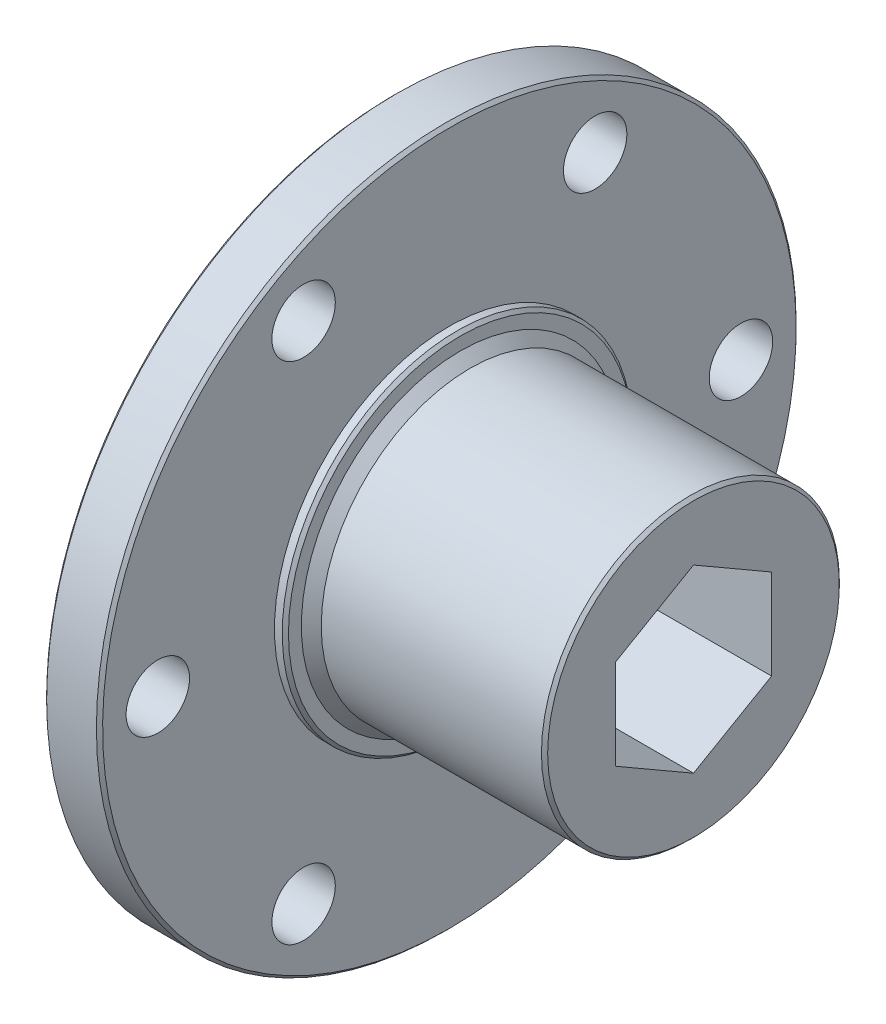
ISO-10303-21;
HEADER;
FILE_DESCRIPTION(('STEP AP214'),'2;1');
FILE_NAME('part.step','',(''),(''),'','','');
FILE_SCHEMA(('AUTOMOTIVE_DESIGN { 1 0 10303 214 1 1 1 1 }'));
ENDSEC;
DATA;
#1=APPLICATION_CONTEXT('core data for automotive mechanical design processes');
#2=APPLICATION_PROTOCOL_DEFINITION('international standard','automotive_design',2000,#1);
#3=PRODUCT_CONTEXT('',#1,'mechanical');
#4=PRODUCT('Part','Part','',(#3));
#5=PRODUCT_RELATED_PRODUCT_CATEGORY('part','',(#4));
#6=PRODUCT_DEFINITION_FORMATION('','',#4);
#7=PRODUCT_DEFINITION_CONTEXT('part definition',#1,'design');
#8=PRODUCT_DEFINITION('design','',#6,#7);
#9=PRODUCT_DEFINITION_SHAPE('','',#8);
#10=(LENGTH_UNIT() NAMED_UNIT(*) SI_UNIT(.MILLI.,.METRE.));
#11=(NAMED_UNIT(*) PLANE_ANGLE_UNIT() SI_UNIT($,.RADIAN.));
#12=(NAMED_UNIT(*) SI_UNIT($,.STERADIAN.) SOLID_ANGLE_UNIT());
#13=UNCERTAINTY_MEASURE_WITH_UNIT(LENGTH_MEASURE(1.E-05),#10,'distance_accuracy_value','');
#14=(GEOMETRIC_REPRESENTATION_CONTEXT(3) GLOBAL_UNCERTAINTY_ASSIGNED_CONTEXT((#13)) GLOBAL_UNIT_ASSIGNED_CONTEXT((#10,
#11,#12)) REPRESENTATION_CONTEXT('',''));
#15=CARTESIAN_POINT('',(0.,0.,0.));
#16=DIRECTION('',(0.,0.,1.));
#17=DIRECTION('',(1.,0.,0.));
#18=AXIS2_PLACEMENT_3D('',#15,#16,#17);
#19=CARTESIAN_POINT('',(6.01493375394323,0.,0.));
#20=DIRECTION('',(-1.,0.,0.));
#21=DIRECTION('',(0.,0.,1.));
#22=AXIS2_PLACEMENT_3D('',#19,#20,#21);
#23=CYLINDRICAL_SURFACE('',#22,12.1666);
#24=CARTESIAN_POINT('',(5.76093375394327,0.,0.));
#25=DIRECTION('',(-1.,0.,0.));
#26=DIRECTION('',(0.,0.,1.));
#27=AXIS2_PLACEMENT_3D('',#24,#25,#26);
#28=CIRCLE('',#27,12.1666);
#29=CARTESIAN_POINT('',(5.76093375394327,0.,12.1666));
#30=VERTEX_POINT('',#29);
#31=EDGE_CURVE('E117',#30,#30,#28,.F.);
#32=ORIENTED_EDGE('',*,*,#31,.F.);
#33=EDGE_LOOP('',(#32));
#34=FACE_BOUND('',#33,.T.);
#35=CARTESIAN_POINT('',(-12.2222662460567,0.,0.));
#36=DIRECTION('',(-1.,0.,0.));
#37=DIRECTION('',(0.,0.,1.));
#38=AXIS2_PLACEMENT_3D('',#35,#36,#37);
#39=CIRCLE('',#38,12.1666);
#40=CARTESIAN_POINT('',(-12.2222662460567,0.,12.1666));
#41=VERTEX_POINT('',#40);
#42=EDGE_CURVE('E113',#41,#41,#39,.T.);
#43=ORIENTED_EDGE('',*,*,#42,.F.);
#44=EDGE_LOOP('',(#43));
#45=FACE_BOUND('',#44,.T.);
#46=ADVANCED_FACE('F16',(#34,#45),#23,.T.);
#47=CARTESIAN_POINT('',(5.76093375394327,0.,0.));
#48=DIRECTION('',(-1.,0.,0.));
#49=DIRECTION('',(0.,0.,1.));
#50=AXIS2_PLACEMENT_3D('',#47,#48,#49);
#51=CONICAL_SURFACE('',#50,12.1666,0.785398163397465);
#52=ORIENTED_EDGE('',*,*,#31,.T.);
#53=EDGE_LOOP('',(#52));
#54=FACE_BOUND('',#53,.T.);
#55=CARTESIAN_POINT('',(6.01493375394323,0.,0.));
#56=DIRECTION('',(-1.,0.,0.));
#57=DIRECTION('',(0.,0.,1.));
#58=AXIS2_PLACEMENT_3D('',#55,#56,#57);
#59=CIRCLE('',#58,11.9126);
#60=CARTESIAN_POINT('',(6.01493375394323,0.,11.9126));
#61=VERTEX_POINT('',#60);
#62=EDGE_CURVE('E19',#61,#61,#59,.F.);
#63=ORIENTED_EDGE('',*,*,#62,.F.);
#64=EDGE_LOOP('',(#63));
#65=FACE_BOUND('',#64,.T.);
#66=ADVANCED_FACE('F194',(#54,#65),#51,.T.);
#67=CARTESIAN_POINT('',(-13.0350662460568,0.,0.));
#68=DIRECTION('',(-1.,0.,0.));
#69=DIRECTION('',(0.,-1.,0.));
#70=AXIS2_PLACEMENT_3D('',#67,#68,#69);
#71=CONICAL_SURFACE('',#70,12.9794,0.785398163397438);
#72=ORIENTED_EDGE('',*,*,#42,.T.);
#73=EDGE_LOOP('',(#72));
#74=FACE_BOUND('',#73,.T.);
#75=CARTESIAN_POINT('',(-13.0350662460568,0.,0.));
#76=DIRECTION('',(-1.,0.,0.));
#77=DIRECTION('',(0.,-1.,0.));
#78=AXIS2_PLACEMENT_3D('',#75,#76,#77);
#79=CIRCLE('',#78,12.9794);
#80=CARTESIAN_POINT('',(-13.0350662460568,-12.9794,0.));
#81=VERTEX_POINT('',#80);
#82=EDGE_CURVE('E92',#81,#81,#79,.T.);
#83=ORIENTED_EDGE('',*,*,#82,.F.);
#84=EDGE_LOOP('',(#83));
#85=FACE_BOUND('',#84,.T.);
#86=ADVANCED_FACE('F196',(#74,#85),#71,.T.);
#87=CARTESIAN_POINT('',(6.01493375394323,0.,0.));
#88=DIRECTION('',(1.,0.,0.));
#89=DIRECTION('',(0.,0.,-1.));
#90=AXIS2_PLACEMENT_3D('',#87,#88,#89);
#91=PLANE('',#90);
#92=DIRECTION('',(0.,1.,0.));
#93=VECTOR('',#92,1.);
#94=CARTESIAN_POINT('',(6.01493375394323,-3.68085890619153,-6.37539999999999));
#95=LINE('',#94,#93);
#96=CARTESIAN_POINT('',(6.01493375394323,3.68081890619155,-6.37539999999999));
#97=VERTEX_POINT('',#96);
#98=CARTESIAN_POINT('',(6.01493375394323,-3.68085890619153,-6.37539999999999));
#99=VERTEX_POINT('',#98);
#100=EDGE_CURVE('E102',#97,#99,#95,.F.);
#101=ORIENTED_EDGE('',*,*,#100,.T.);
#102=DIRECTION('',(0.,0.500000000000001,-0.866025403784438));
#103=VECTOR('',#102,1.);
#104=CARTESIAN_POINT('',(6.01493375394323,-7.36169781238308,0.));
#105=LINE('',#104,#103);
#106=CARTESIAN_POINT('',(6.01493375394323,-7.36169781238308,0.));
#107=VERTEX_POINT('',#106);
#108=EDGE_CURVE('E75',#99,#107,#105,.F.);
#109=ORIENTED_EDGE('',*,*,#108,.T.);
#110=DIRECTION('',(0.,-0.500000000000001,-0.866025403784438));
#111=VECTOR('',#110,1.);
#112=CARTESIAN_POINT('',(6.01493375394323,-3.68085890619153,6.3754));
#113=LINE('',#112,#111);
#114=CARTESIAN_POINT('',(6.01493375394323,-3.68085890619153,6.3754));
#115=VERTEX_POINT('',#114);
#116=EDGE_CURVE('E82',#107,#115,#113,.F.);
#117=ORIENTED_EDGE('',*,*,#116,.T.);
#118=DIRECTION('',(0.,-1.,0.));
#119=VECTOR('',#118,1.);
#120=CARTESIAN_POINT('',(6.01493375394323,3.68081890619155,6.3754));
#121=LINE('',#120,#119);
#122=CARTESIAN_POINT('',(6.01493375394323,3.68081890619155,6.3754));
#123=VERTEX_POINT('',#122);
#124=EDGE_CURVE('E185',#115,#123,#121,.F.);
#125=ORIENTED_EDGE('',*,*,#124,.T.);
#126=DIRECTION('',(0.,-0.500000000000001,0.866025403784438));
#127=VECTOR('',#126,1.);
#128=CARTESIAN_POINT('',(6.01493375394323,7.3616578123831,0.));
#129=LINE('',#128,#127);
#130=CARTESIAN_POINT('',(6.01493375394323,7.3616578123831,0.));
#131=VERTEX_POINT('',#130);
#132=EDGE_CURVE('E517',#123,#131,#129,.F.);
#133=ORIENTED_EDGE('',*,*,#132,.T.);
#134=DIRECTION('',(0.,0.500000000000001,0.866025403784438));
#135=VECTOR('',#134,1.);
#136=CARTESIAN_POINT('',(6.01493375394323,3.68081890619155,-6.37539999999999));
#137=LINE('',#136,#135);
#138=EDGE_CURVE('E525',#131,#97,#137,.F.);
#139=ORIENTED_EDGE('',*,*,#138,.T.);
#140=EDGE_LOOP('',(#101,#109,#117,#125,#133,#139));
#141=FACE_BOUND('',#140,.T.);
#142=ORIENTED_EDGE('',*,*,#62,.T.);
#143=EDGE_LOOP('',(#142));
#144=FACE_BOUND('',#143,.T.);
#145=ADVANCED_FACE('F99',(#141,#144),#91,.T.);
#146=CARTESIAN_POINT('',(-13.0350662460568,28.575,0.));
#147=DIRECTION('',(1.,0.,0.));
#148=DIRECTION('',(0.,0.,-1.));
#149=AXIS2_PLACEMENT_3D('',#146,#147,#148);
#150=PLANE('',#149);
#151=ORIENTED_EDGE('',*,*,#82,.T.);
#152=EDGE_LOOP('',(#151));
#153=FACE_BOUND('',#152,.T.);
#154=CARTESIAN_POINT('',(-13.0350662460568,0.,0.));
#155=DIRECTION('',(-1.,0.,0.));
#156=DIRECTION('',(0.,-1.,0.));
#157=AXIS2_PLACEMENT_3D('',#154,#155,#156);
#158=CIRCLE('',#157,14.0335);
#159=CARTESIAN_POINT('',(-13.0350662460568,-14.0335,0.));
#160=VERTEX_POINT('',#159);
#161=EDGE_CURVE('E181',#160,#160,#158,.T.);
#162=ORIENTED_EDGE('',*,*,#161,.F.);
#163=EDGE_LOOP('',(#162));
#164=FACE_BOUND('',#163,.T.);
#165=ADVANCED_FACE('F294',(#153,#164),#150,.T.);
#166=CARTESIAN_POINT('',(-19.3850662460568,-3.68085890619153,6.3754));
#167=DIRECTION('',(0.,-0.866025403784438,0.500000000000001));
#168=DIRECTION('',(0.,-0.500000000000001,-0.866025403784438));
#169=AXIS2_PLACEMENT_3D('',#166,#167,#168);
#170=PLANE('',#169);
#171=DIRECTION('',(1.,0.,0.));
#172=VECTOR('',#171,1.);
#173=CARTESIAN_POINT('',(-19.3850662460568,-7.36169781238308,0.));
#174=LINE('',#173,#172);
#175=CARTESIAN_POINT('',(-19.3850662460568,-7.36169781238308,0.));
#176=VERTEX_POINT('',#175);
#177=EDGE_CURVE('E85',#107,#176,#174,.F.);
#178=ORIENTED_EDGE('',*,*,#177,.T.);
#179=DIRECTION('',(0.,-0.500000000000001,-0.866025403784438));
#180=VECTOR('',#179,1.);
#181=CARTESIAN_POINT('',(-19.3850662460568,-3.68085890619153,6.3754));
#182=LINE('',#181,#180);
#183=CARTESIAN_POINT('',(-19.3850662460568,-3.68085890619153,6.3754));
#184=VERTEX_POINT('',#183);
#185=EDGE_CURVE('E184',#184,#176,#182,.T.);
#186=ORIENTED_EDGE('',*,*,#185,.F.);
#187=DIRECTION('',(1.,0.,0.));
#188=VECTOR('',#187,1.);
#189=CARTESIAN_POINT('',(-19.3850662460568,-3.68085890619153,6.3754));
#190=LINE('',#189,#188);
#191=EDGE_CURVE('E87',#184,#115,#190,.T.);
#192=ORIENTED_EDGE('',*,*,#191,.T.);
#193=ORIENTED_EDGE('',*,*,#116,.F.);
#194=EDGE_LOOP('',(#178,#186,#192,#193));
#195=FACE_BOUND('',#194,.T.);
#196=ADVANCED_FACE('F83',(#195),#170,.F.);
#197=CARTESIAN_POINT('',(-19.3850662460568,-7.36169781238308,0.));
#198=DIRECTION('',(0.,-0.866025403784438,-0.500000000000001));
#199=DIRECTION('',(0.,0.500000000000001,-0.866025403784438));
#200=AXIS2_PLACEMENT_3D('',#197,#198,#199);
#201=PLANE('',#200);
#202=DIRECTION('',(1.,0.,0.));
#203=VECTOR('',#202,1.);
#204=CARTESIAN_POINT('',(-19.3850662460568,-3.68085890619153,-6.37539999999999));
#205=LINE('',#204,#203);
#206=CARTESIAN_POINT('',(-19.3850662460568,-3.68085890619153,-6.37539999999999));
#207=VERTEX_POINT('',#206);
#208=EDGE_CURVE('E104',#99,#207,#205,.F.);
#209=ORIENTED_EDGE('',*,*,#208,.T.);
#210=DIRECTION('',(0.,0.500000000000001,-0.866025403784438));
#211=VECTOR('',#210,1.);
#212=CARTESIAN_POINT('',(-19.3850662460568,-7.36169781238308,0.));
#213=LINE('',#212,#211);
#214=EDGE_CURVE('E95',#176,#207,#213,.T.);
#215=ORIENTED_EDGE('',*,*,#214,.F.);
#216=ORIENTED_EDGE('',*,*,#177,.F.);
#217=ORIENTED_EDGE('',*,*,#108,.F.);
#218=EDGE_LOOP('',(#209,#215,#216,#217));
#219=FACE_BOUND('',#218,.T.);
#220=ADVANCED_FACE('F94',(#219),#201,.F.);
#221=CARTESIAN_POINT('',(-19.3850662460568,-3.68085890619153,-6.37539999999999));
#222=DIRECTION('',(0.,0.,-1.));
#223=DIRECTION('',(0.,1.,0.));
#224=AXIS2_PLACEMENT_3D('',#221,#222,#223);
#225=PLANE('',#224);
#226=DIRECTION('',(1.,0.,0.));
#227=VECTOR('',#226,1.);
#228=CARTESIAN_POINT('',(-19.3850662460568,3.68081890619155,-6.37539999999999));
#229=LINE('',#228,#227);
#230=CARTESIAN_POINT('',(-19.3850662460568,3.68081890619155,-6.37539999999999));
#231=VERTEX_POINT('',#230);
#232=EDGE_CURVE('E528',#97,#231,#229,.F.);
#233=ORIENTED_EDGE('',*,*,#232,.T.);
#234=DIRECTION('',(0.,1.,0.));
#235=VECTOR('',#234,1.);
#236=CARTESIAN_POINT('',(-19.3850662460568,0.,-6.37539999999999));
#237=LINE('',#236,#235);
#238=EDGE_CURVE('E534',#207,#231,#237,.T.);
#239=ORIENTED_EDGE('',*,*,#238,.F.);
#240=ORIENTED_EDGE('',*,*,#208,.F.);
#241=ORIENTED_EDGE('',*,*,#100,.F.);
#242=EDGE_LOOP('',(#233,#239,#240,#241));
#243=FACE_BOUND('',#242,.T.);
#244=ADVANCED_FACE('F285',(#243),#225,.F.);
#245=CARTESIAN_POINT('',(-19.3850662460568,3.68081890619155,-6.37539999999999));
#246=DIRECTION('',(0.,0.866025403784438,-0.500000000000001));
#247=DIRECTION('',(0.,0.500000000000001,0.866025403784438));
#248=AXIS2_PLACEMENT_3D('',#245,#246,#247);
#249=PLANE('',#248);
#250=DIRECTION('',(1.,0.,0.));
#251=VECTOR('',#250,1.);
#252=CARTESIAN_POINT('',(-19.3850662460568,7.3616578123831,0.));
#253=LINE('',#252,#251);
#254=CARTESIAN_POINT('',(-19.3850662460568,7.3616578123831,0.));
#255=VERTEX_POINT('',#254);
#256=EDGE_CURVE('E521',#131,#255,#253,.F.);
#257=ORIENTED_EDGE('',*,*,#256,.T.);
#258=DIRECTION('',(0.,0.500000000000001,0.866025403784438));
#259=VECTOR('',#258,1.);
#260=CARTESIAN_POINT('',(-19.3850662460568,3.68081890619155,-6.37539999999999));
#261=LINE('',#260,#259);
#262=EDGE_CURVE('E539',#231,#255,#261,.T.);
#263=ORIENTED_EDGE('',*,*,#262,.F.);
#264=ORIENTED_EDGE('',*,*,#232,.F.);
#265=ORIENTED_EDGE('',*,*,#138,.F.);
#266=EDGE_LOOP('',(#257,#263,#264,#265));
#267=FACE_BOUND('',#266,.T.);
#268=ADVANCED_FACE('F281',(#267),#249,.F.);
#269=CARTESIAN_POINT('',(-19.3850662460568,7.3616578123831,0.));
#270=DIRECTION('',(0.,0.866025403784438,0.500000000000001));
#271=DIRECTION('',(0.,-0.500000000000001,0.866025403784438));
#272=AXIS2_PLACEMENT_3D('',#269,#270,#271);
#273=PLANE('',#272);
#274=DIRECTION('',(1.,0.,0.));
#275=VECTOR('',#274,1.);
#276=CARTESIAN_POINT('',(-19.3850662460568,3.68081890619155,6.3754));
#277=LINE('',#276,#275);
#278=CARTESIAN_POINT('',(-19.3850662460568,3.68081890619155,6.3754));
#279=VERTEX_POINT('',#278);
#280=EDGE_CURVE('E514',#123,#279,#277,.F.);
#281=ORIENTED_EDGE('',*,*,#280,.T.);
#282=DIRECTION('',(0.,-0.500000000000001,0.866025403784438));
#283=VECTOR('',#282,1.);
#284=CARTESIAN_POINT('',(-19.3850662460568,7.3616578123831,0.));
#285=LINE('',#284,#283);
#286=EDGE_CURVE('E34',#255,#279,#285,.T.);
#287=ORIENTED_EDGE('',*,*,#286,.F.);
#288=ORIENTED_EDGE('',*,*,#256,.F.);
#289=ORIENTED_EDGE('',*,*,#132,.F.);
#290=EDGE_LOOP('',(#281,#287,#288,#289));
#291=FACE_BOUND('',#290,.T.);
#292=ADVANCED_FACE('F277',(#291),#273,.F.);
#293=CARTESIAN_POINT('',(-19.3850662460568,3.68081890619155,6.3754));
#294=DIRECTION('',(0.,0.,1.));
#295=DIRECTION('',(0.,-1.,0.));
#296=AXIS2_PLACEMENT_3D('',#293,#294,#295);
#297=PLANE('',#296);
#298=ORIENTED_EDGE('',*,*,#191,.F.);
#299=DIRECTION('',(0.,1.,0.));
#300=VECTOR('',#299,1.);
#301=CARTESIAN_POINT('',(-19.3850662460568,0.,6.3754));
#302=LINE('',#301,#300);
#303=EDGE_CURVE('E502',#279,#184,#302,.F.);
#304=ORIENTED_EDGE('',*,*,#303,.F.);
#305=ORIENTED_EDGE('',*,*,#280,.F.);
#306=ORIENTED_EDGE('',*,*,#124,.F.);
#307=EDGE_LOOP('',(#298,#304,#305,#306));
#308=FACE_BOUND('',#307,.T.);
#309=ADVANCED_FACE('F273',(#308),#297,.F.);
#310=CARTESIAN_POINT('',(-13.2890662460568,0.,0.));
#311=DIRECTION('',(-1.,0.,0.));
#312=DIRECTION('',(0.,-1.,0.));
#313=AXIS2_PLACEMENT_3D('',#310,#311,#312);
#314=CONICAL_SURFACE('',#313,14.2875,0.785398163397452);
#315=ORIENTED_EDGE('',*,*,#161,.T.);
#316=EDGE_LOOP('',(#315));
#317=FACE_BOUND('',#316,.T.);
#318=CARTESIAN_POINT('',(-13.2890662460568,0.,0.));
#319=DIRECTION('',(1.,0.,0.));
#320=DIRECTION('',(0.,0.,-1.));
#321=AXIS2_PLACEMENT_3D('',#318,#319,#320);
#322=CIRCLE('',#321,14.2875);
#323=CARTESIAN_POINT('',(-13.2890662460568,0.,-14.2875));
#324=VERTEX_POINT('',#323);
#325=EDGE_CURVE('E499',#324,#324,#322,.F.);
#326=ORIENTED_EDGE('',*,*,#325,.F.);
#327=EDGE_LOOP('',(#326));
#328=FACE_BOUND('',#327,.T.);
#329=ADVANCED_FACE('F270',(#317,#328),#314,.T.);
#330=CARTESIAN_POINT('',(-19.3850662460568,0.,0.));
#331=DIRECTION('',(-1.,0.,0.));
#332=DIRECTION('',(0.,0.,1.));
#333=AXIS2_PLACEMENT_3D('',#330,#331,#332);
#334=PLANE('',#333);
#335=ORIENTED_EDGE('',*,*,#286,.T.);
#336=ORIENTED_EDGE('',*,*,#303,.T.);
#337=ORIENTED_EDGE('',*,*,#185,.T.);
#338=ORIENTED_EDGE('',*,*,#214,.T.);
#339=ORIENTED_EDGE('',*,*,#238,.T.);
#340=ORIENTED_EDGE('',*,*,#262,.T.);
#341=EDGE_LOOP('',(#335,#336,#337,#338,#339,#340));
#342=FACE_BOUND('',#341,.T.);
#343=CARTESIAN_POINT('',(-19.3850662460568,0.,0.));
#344=DIRECTION('',(1.,0.,0.));
#345=DIRECTION('',(0.,0.,-1.));
#346=AXIS2_PLACEMENT_3D('',#343,#344,#345);
#347=CIRCLE('',#346,14.0335);
#348=CARTESIAN_POINT('',(-19.3850662460568,0.,-14.0335));
#349=VERTEX_POINT('',#348);
#350=EDGE_CURVE('E176',#349,#349,#347,.T.);
#351=ORIENTED_EDGE('',*,*,#350,.F.);
#352=EDGE_LOOP('',(#351));
#353=FACE_BOUND('',#352,.T.);
#354=ADVANCED_FACE('F266',(#342,#353),#334,.T.);
#355=CARTESIAN_POINT('',(-14.1780662460568,0.,0.));
#356=DIRECTION('',(-1.,0.,0.));
#357=DIRECTION('',(0.,-1.,0.));
#358=AXIS2_PLACEMENT_3D('',#355,#356,#357);
#359=CONICAL_SURFACE('',#358,28.575,0.785398163397445);
#360=CARTESIAN_POINT('',(-14.1780662460568,0.,0.));
#361=DIRECTION('',(-1.,0.,0.));
#362=DIRECTION('',(0.,0.,1.));
#363=AXIS2_PLACEMENT_3D('',#360,#361,#362);
#364=CIRCLE('',#363,28.575);
#365=CARTESIAN_POINT('',(-14.1780662460568,0.,28.575));
#366=VERTEX_POINT('',#365);
#367=EDGE_CURVE('E180',#366,#366,#364,.T.);
#368=ORIENTED_EDGE('',*,*,#367,.F.);
#369=EDGE_LOOP('',(#368));
#370=FACE_BOUND('',#369,.T.);
#371=CARTESIAN_POINT('',(-13.9240662460568,0.,0.));
#372=DIRECTION('',(-1.,0.,0.));
#373=DIRECTION('',(0.,-1.,0.));
#374=AXIS2_PLACEMENT_3D('',#371,#372,#373);
#375=CIRCLE('',#374,28.321);
#376=CARTESIAN_POINT('',(-13.9240662460568,-28.321,0.));
#377=VERTEX_POINT('',#376);
#378=EDGE_CURVE('E172',#377,#377,#375,.F.);
#379=ORIENTED_EDGE('',*,*,#378,.F.);
#380=EDGE_LOOP('',(#379));
#381=FACE_BOUND('',#380,.T.);
#382=ADVANCED_FACE('F262',(#370,#381),#359,.T.);
#383=CARTESIAN_POINT('',(14.3030238953624,0.,0.));
#384=DIRECTION('',(1.,0.,0.));
#385=DIRECTION('',(0.,0.,-1.));
#386=AXIS2_PLACEMENT_3D('',#383,#384,#385);
#387=CYLINDRICAL_SURFACE('',#386,14.2875);
#388=CARTESIAN_POINT('',(-13.9240662460568,0.,0.));
#389=DIRECTION('',(1.,0.,0.));
#390=DIRECTION('',(0.,0.,-1.));
#391=AXIS2_PLACEMENT_3D('',#388,#389,#390);
#392=CIRCLE('',#391,14.2875);
#393=CARTESIAN_POINT('',(-13.9240662460568,0.,-14.2875));
#394=VERTEX_POINT('',#393);
#395=EDGE_CURVE('E168',#394,#394,#392,.F.);
#396=ORIENTED_EDGE('',*,*,#395,.F.);
#397=EDGE_LOOP('',(#396));
#398=FACE_BOUND('',#397,.T.);
#399=ORIENTED_EDGE('',*,*,#325,.T.);
#400=EDGE_LOOP('',(#399));
#401=FACE_BOUND('',#400,.T.);
#402=ADVANCED_FACE('F258',(#398,#401),#387,.T.);
#403=CARTESIAN_POINT('',(-13.0350662460568,0.,0.));
#404=DIRECTION('',(-1.,0.,0.));
#405=DIRECTION('',(0.,0.,1.));
#406=AXIS2_PLACEMENT_3D('',#403,#404,#405);
#407=CYLINDRICAL_SURFACE('',#406,28.575);
#408=ORIENTED_EDGE('',*,*,#367,.T.);
#409=EDGE_LOOP('',(#408));
#410=FACE_BOUND('',#409,.T.);
#411=CARTESIAN_POINT('',(-18.2420662460568,0.,0.));
#412=DIRECTION('',(1.,0.,0.));
#413=DIRECTION('',(0.,0.,-1.));
#414=AXIS2_PLACEMENT_3D('',#411,#412,#413);
#415=CIRCLE('',#414,28.575);
#416=CARTESIAN_POINT('',(-18.2420662460568,0.,-28.575));
#417=VERTEX_POINT('',#416);
#418=EDGE_CURVE('E167',#417,#417,#415,.F.);
#419=ORIENTED_EDGE('',*,*,#418,.F.);
#420=EDGE_LOOP('',(#419));
#421=FACE_BOUND('',#420,.T.);
#422=ADVANCED_FACE('F254',(#410,#421),#407,.T.);
#423=CARTESIAN_POINT('',(-19.1310662460568,0.,0.));
#424=DIRECTION('',(1.,0.,0.));
#425=DIRECTION('',(0.,0.,-1.));
#426=AXIS2_PLACEMENT_3D('',#423,#424,#425);
#427=CONICAL_SURFACE('',#426,14.2875,0.785398163397452);
#428=CARTESIAN_POINT('',(-19.1310662460568,0.,0.));
#429=DIRECTION('',(1.,0.,0.));
#430=DIRECTION('',(0.,0.,-1.));
#431=AXIS2_PLACEMENT_3D('',#428,#429,#430);
#432=CIRCLE('',#431,14.2875);
#433=CARTESIAN_POINT('',(-19.1310662460568,0.,-14.2875));
#434=VERTEX_POINT('',#433);
#435=EDGE_CURVE('E155',#434,#434,#432,.T.);
#436=ORIENTED_EDGE('',*,*,#435,.F.);
#437=EDGE_LOOP('',(#436));
#438=FACE_BOUND('',#437,.T.);
#439=ORIENTED_EDGE('',*,*,#350,.T.);
#440=EDGE_LOOP('',(#439));
#441=FACE_BOUND('',#440,.T.);
#442=ADVANCED_FACE('F250',(#438,#441),#427,.T.);
#443=CARTESIAN_POINT('',(-13.9240662460568,0.,5.72637987752451));
#444=DIRECTION('',(1.,0.,0.));
#445=DIRECTION('',(0.,0.,-1.));
#446=AXIS2_PLACEMENT_3D('',#443,#444,#445);
#447=PLANE('',#446);
#448=CARTESIAN_POINT('',(-13.9240662460568,0.,23.8125));
#449=DIRECTION('',(1.,0.,0.));
#450=DIRECTION('',(0.,0.,-1.));
#451=AXIS2_PLACEMENT_3D('',#448,#449,#450);
#452=CIRCLE('',#451,2.59080000000001);
#453=CARTESIAN_POINT('',(-13.9240662460568,0.,21.2217));
#454=VERTEX_POINT('',#453);
#455=EDGE_CURVE('E145',#454,#454,#452,.F.);
#456=ORIENTED_EDGE('',*,*,#455,.T.);
#457=EDGE_LOOP('',(#456));
#458=FACE_BOUND('',#457,.T.);
#459=CARTESIAN_POINT('',(-13.9240662460568,20.622229927617,-11.90625));
#460=DIRECTION('',(1.,0.,0.));
#461=DIRECTION('',(0.,0.,-1.));
#462=AXIS2_PLACEMENT_3D('',#459,#460,#461);
#463=CIRCLE('',#462,2.59080000000001);
#464=CARTESIAN_POINT('',(-13.9240662460568,20.622229927617,-14.49705));
#465=VERTEX_POINT('',#464);
#466=EDGE_CURVE('E148',#465,#465,#463,.F.);
#467=ORIENTED_EDGE('',*,*,#466,.T.);
#468=EDGE_LOOP('',(#467));
#469=FACE_BOUND('',#468,.T.);
#470=CARTESIAN_POINT('',(-13.9240662460568,-20.6222299276169,-11.90625));
#471=DIRECTION('',(1.,0.,0.));
#472=DIRECTION('',(0.,0.,-1.));
#473=AXIS2_PLACEMENT_3D('',#470,#471,#472);
#474=CIRCLE('',#473,2.59080000000001);
#475=CARTESIAN_POINT('',(-13.9240662460568,-20.6222299276169,-14.4970500000001));
#476=VERTEX_POINT('',#475);
#477=EDGE_CURVE('E151',#476,#476,#474,.F.);
#478=ORIENTED_EDGE('',*,*,#477,.T.);
#479=EDGE_LOOP('',(#478));
#480=FACE_BOUND('',#479,.T.);
#481=ORIENTED_EDGE('',*,*,#395,.T.);
#482=EDGE_LOOP('',(#481));
#483=FACE_BOUND('',#482,.T.);
#484=CARTESIAN_POINT('',(-13.9240662460568,-20.622229927617,11.9062499999999));
#485=DIRECTION('',(1.,0.,0.));
#486=DIRECTION('',(0.,0.,-1.));
#487=AXIS2_PLACEMENT_3D('',#484,#485,#486);
#488=CIRCLE('',#487,2.59080000000001);
#489=CARTESIAN_POINT('',(-13.9240662460568,-20.622229927617,9.31544999999993));
#490=VERTEX_POINT('',#489);
#491=EDGE_CURVE('E156',#490,#490,#488,.F.);
#492=ORIENTED_EDGE('',*,*,#491,.T.);
#493=EDGE_LOOP('',(#492));
#494=FACE_BOUND('',#493,.T.);
#495=CARTESIAN_POINT('',(-13.9240662460568,0.,-23.8125));
#496=DIRECTION('',(1.,0.,0.));
#497=DIRECTION('',(0.,0.,-1.));
#498=AXIS2_PLACEMENT_3D('',#495,#496,#497);
#499=CIRCLE('',#498,2.59080000000001);
#500=CARTESIAN_POINT('',(-13.9240662460568,0.,-26.4033));
#501=VERTEX_POINT('',#500);
#502=EDGE_CURVE('E160',#501,#501,#499,.F.);
#503=ORIENTED_EDGE('',*,*,#502,.T.);
#504=EDGE_LOOP('',(#503));
#505=FACE_BOUND('',#504,.T.);
#506=CARTESIAN_POINT('',(-13.9240662460568,20.6222299276169,11.90625));
#507=DIRECTION('',(1.,0.,0.));
#508=DIRECTION('',(0.,0.,-1.));
#509=AXIS2_PLACEMENT_3D('',#506,#507,#508);
#510=CIRCLE('',#509,2.59080000000001);
#511=CARTESIAN_POINT('',(-13.9240662460568,20.6222299276169,9.31544999999999));
#512=VERTEX_POINT('',#511);
#513=EDGE_CURVE('E164',#512,#512,#510,.F.);
#514=ORIENTED_EDGE('',*,*,#513,.T.);
#515=EDGE_LOOP('',(#514));
#516=FACE_BOUND('',#515,.T.);
#517=ORIENTED_EDGE('',*,*,#378,.T.);
#518=EDGE_LOOP('',(#517));
#519=FACE_BOUND('',#518,.T.);
#520=ADVANCED_FACE('F246',(#458,#469,#480,#483,#494,#505,#516,#519),#447,.T.);
#521=CARTESIAN_POINT('',(-18.2420662460568,0.,0.));
#522=DIRECTION('',(1.,0.,0.));
#523=DIRECTION('',(0.,0.,-1.));
#524=AXIS2_PLACEMENT_3D('',#521,#522,#523);
#525=CONICAL_SURFACE('',#524,28.575,0.785398163397448);
#526=CARTESIAN_POINT('',(-18.4960662460568,0.,0.));
#527=DIRECTION('',(1.,0.,0.));
#528=DIRECTION('',(0.,0.,-1.));
#529=AXIS2_PLACEMENT_3D('',#526,#527,#528);
#530=CIRCLE('',#529,28.321);
#531=CARTESIAN_POINT('',(-18.4960662460568,0.,-28.321));
#532=VERTEX_POINT('',#531);
#533=EDGE_CURVE('E141',#532,#532,#530,.T.);
#534=ORIENTED_EDGE('',*,*,#533,.T.);
#535=EDGE_LOOP('',(#534));
#536=FACE_BOUND('',#535,.T.);
#537=ORIENTED_EDGE('',*,*,#418,.T.);
#538=EDGE_LOOP('',(#537));
#539=FACE_BOUND('',#538,.T.);
#540=ADVANCED_FACE('F242',(#536,#539),#525,.T.);
#541=CARTESIAN_POINT('',(-13.0350662460568,20.6222299276169,11.90625));
#542=DIRECTION('',(1.,0.,0.));
#543=DIRECTION('',(0.,0.,-1.));
#544=AXIS2_PLACEMENT_3D('',#541,#542,#543);
#545=CYLINDRICAL_SURFACE('',#544,2.59080000000001);
#546=ORIENTED_EDGE('',*,*,#513,.F.);
#547=EDGE_LOOP('',(#546));
#548=FACE_BOUND('',#547,.T.);
#549=CARTESIAN_POINT('',(-18.4960662460568,20.6222299276169,11.90625));
#550=DIRECTION('',(1.,0.,0.));
#551=DIRECTION('',(0.,0.,-1.));
#552=AXIS2_PLACEMENT_3D('',#549,#550,#551);
#553=CIRCLE('',#552,2.59080000000001);
#554=CARTESIAN_POINT('',(-18.4960662460568,20.6222299276169,9.31544999999999));
#555=VERTEX_POINT('',#554);
#556=EDGE_CURVE('E138',#555,#555,#553,.F.);
#557=ORIENTED_EDGE('',*,*,#556,.T.);
#558=EDGE_LOOP('',(#557));
#559=FACE_BOUND('',#558,.T.);
#560=ADVANCED_FACE('F238',(#548,#559),#545,.F.);
#561=CARTESIAN_POINT('',(-13.0350662460568,0.,-23.8125));
#562=DIRECTION('',(1.,0.,0.));
#563=DIRECTION('',(0.,0.,-1.));
#564=AXIS2_PLACEMENT_3D('',#561,#562,#563);
#565=CYLINDRICAL_SURFACE('',#564,2.59080000000001);
#566=ORIENTED_EDGE('',*,*,#502,.F.);
#567=EDGE_LOOP('',(#566));
#568=FACE_BOUND('',#567,.T.);
#569=CARTESIAN_POINT('',(-18.4960662460568,0.,-23.8125));
#570=DIRECTION('',(1.,0.,0.));
#571=DIRECTION('',(0.,0.,-1.));
#572=AXIS2_PLACEMENT_3D('',#569,#570,#571);
#573=CIRCLE('',#572,2.59080000000001);
#574=CARTESIAN_POINT('',(-18.4960662460568,0.,-26.4033));
#575=VERTEX_POINT('',#574);
#576=EDGE_CURVE('E134',#575,#575,#573,.F.);
#577=ORIENTED_EDGE('',*,*,#576,.T.);
#578=EDGE_LOOP('',(#577));
#579=FACE_BOUND('',#578,.T.);
#580=ADVANCED_FACE('F234',(#568,#579),#565,.F.);
#581=CARTESIAN_POINT('',(-13.0350662460568,-20.622229927617,11.9062499999999));
#582=DIRECTION('',(1.,0.,0.));
#583=DIRECTION('',(0.,0.,-1.));
#584=AXIS2_PLACEMENT_3D('',#581,#582,#583);
#585=CYLINDRICAL_SURFACE('',#584,2.59080000000001);
#586=ORIENTED_EDGE('',*,*,#491,.F.);
#587=EDGE_LOOP('',(#586));
#588=FACE_BOUND('',#587,.T.);
#589=CARTESIAN_POINT('',(-18.4960662460568,-20.622229927617,11.9062499999999));
#590=DIRECTION('',(1.,0.,0.));
#591=DIRECTION('',(0.,0.,-1.));
#592=AXIS2_PLACEMENT_3D('',#589,#590,#591);
#593=CIRCLE('',#592,2.59080000000001);
#594=CARTESIAN_POINT('',(-18.4960662460568,-20.622229927617,9.31544999999993));
#595=VERTEX_POINT('',#594);
#596=EDGE_CURVE('E131',#595,#595,#593,.F.);
#597=ORIENTED_EDGE('',*,*,#596,.T.);
#598=EDGE_LOOP('',(#597));
#599=FACE_BOUND('',#598,.T.);
#600=ADVANCED_FACE('F230',(#588,#599),#585,.F.);
#601=CARTESIAN_POINT('',(14.3030238953624,0.,0.));
#602=DIRECTION('',(1.,0.,0.));
#603=DIRECTION('',(0.,0.,-1.));
#604=AXIS2_PLACEMENT_3D('',#601,#602,#603);
#605=CYLINDRICAL_SURFACE('',#604,14.2875);
#606=CARTESIAN_POINT('',(-18.4960662460568,0.,0.));
#607=DIRECTION('',(1.,0.,0.));
#608=DIRECTION('',(0.,0.,-1.));
#609=AXIS2_PLACEMENT_3D('',#606,#607,#608);
#610=CIRCLE('',#609,14.2875);
#611=CARTESIAN_POINT('',(-18.4960662460568,0.,-14.2875));
#612=VERTEX_POINT('',#611);
#613=EDGE_CURVE('E127',#612,#612,#610,.F.);
#614=ORIENTED_EDGE('',*,*,#613,.T.);
#615=EDGE_LOOP('',(#614));
#616=FACE_BOUND('',#615,.T.);
#617=ORIENTED_EDGE('',*,*,#435,.T.);
#618=EDGE_LOOP('',(#617));
#619=FACE_BOUND('',#618,.T.);
#620=ADVANCED_FACE('F226',(#616,#619),#605,.T.);
#621=CARTESIAN_POINT('',(-13.0350662460568,-20.6222299276169,-11.90625));
#622=DIRECTION('',(1.,0.,0.));
#623=DIRECTION('',(0.,0.,-1.));
#624=AXIS2_PLACEMENT_3D('',#621,#622,#623);
#625=CYLINDRICAL_SURFACE('',#624,2.59080000000001);
#626=ORIENTED_EDGE('',*,*,#477,.F.);
#627=EDGE_LOOP('',(#626));
#628=FACE_BOUND('',#627,.T.);
#629=CARTESIAN_POINT('',(-18.4960662460568,-20.6222299276169,-11.90625));
#630=DIRECTION('',(1.,0.,0.));
#631=DIRECTION('',(0.,0.,-1.));
#632=AXIS2_PLACEMENT_3D('',#629,#630,#631);
#633=CIRCLE('',#632,2.59080000000001);
#634=CARTESIAN_POINT('',(-18.4960662460568,-20.6222299276169,-14.4970500000001));
#635=VERTEX_POINT('',#634);
#636=EDGE_CURVE('E123',#635,#635,#633,.F.);
#637=ORIENTED_EDGE('',*,*,#636,.T.);
#638=EDGE_LOOP('',(#637));
#639=FACE_BOUND('',#638,.T.);
#640=ADVANCED_FACE('F222',(#628,#639),#625,.F.);
#641=CARTESIAN_POINT('',(-13.0350662460568,20.622229927617,-11.90625));
#642=DIRECTION('',(1.,0.,0.));
#643=DIRECTION('',(0.,0.,-1.));
#644=AXIS2_PLACEMENT_3D('',#641,#642,#643);
#645=CYLINDRICAL_SURFACE('',#644,2.59080000000001);
#646=ORIENTED_EDGE('',*,*,#466,.F.);
#647=EDGE_LOOP('',(#646));
#648=FACE_BOUND('',#647,.T.);
#649=CARTESIAN_POINT('',(-18.4960662460568,20.622229927617,-11.90625));
#650=DIRECTION('',(1.,0.,0.));
#651=DIRECTION('',(0.,0.,-1.));
#652=AXIS2_PLACEMENT_3D('',#649,#650,#651);
#653=CIRCLE('',#652,2.59080000000001);
#654=CARTESIAN_POINT('',(-18.4960662460568,20.622229927617,-14.49705));
#655=VERTEX_POINT('',#654);
#656=EDGE_CURVE('E25',#655,#655,#653,.F.);
#657=ORIENTED_EDGE('',*,*,#656,.T.);
#658=EDGE_LOOP('',(#657));
#659=FACE_BOUND('',#658,.T.);
#660=ADVANCED_FACE('F214',(#648,#659),#645,.F.);
#661=CARTESIAN_POINT('',(-13.0350662460568,0.,23.8125));
#662=DIRECTION('',(1.,0.,0.));
#663=DIRECTION('',(0.,0.,-1.));
#664=AXIS2_PLACEMENT_3D('',#661,#662,#663);
#665=CYLINDRICAL_SURFACE('',#664,2.59080000000001);
#666=ORIENTED_EDGE('',*,*,#455,.F.);
#667=EDGE_LOOP('',(#666));
#668=FACE_BOUND('',#667,.T.);
#669=CARTESIAN_POINT('',(-18.4960662460568,0.,23.8125));
#670=DIRECTION('',(1.,0.,0.));
#671=DIRECTION('',(0.,0.,-1.));
#672=AXIS2_PLACEMENT_3D('',#669,#670,#671);
#673=CIRCLE('',#672,2.59080000000001);
#674=CARTESIAN_POINT('',(-18.4960662460568,0.,21.2217));
#675=VERTEX_POINT('',#674);
#676=EDGE_CURVE('E11',#675,#675,#673,.F.);
#677=ORIENTED_EDGE('',*,*,#676,.T.);
#678=EDGE_LOOP('',(#677));
#679=FACE_BOUND('',#678,.T.);
#680=ADVANCED_FACE('F208',(#668,#679),#665,.F.);
#681=CARTESIAN_POINT('',(-18.4960662460568,0.,14.2875));
#682=DIRECTION('',(1.,0.,0.));
#683=DIRECTION('',(0.,0.,-1.));
#684=AXIS2_PLACEMENT_3D('',#681,#682,#683);
#685=PLANE('',#684);
#686=ORIENTED_EDGE('',*,*,#676,.F.);
#687=EDGE_LOOP('',(#686));
#688=FACE_BOUND('',#687,.T.);
#689=ORIENTED_EDGE('',*,*,#656,.F.);
#690=EDGE_LOOP('',(#689));
#691=FACE_BOUND('',#690,.T.);
#692=ORIENTED_EDGE('',*,*,#636,.F.);
#693=EDGE_LOOP('',(#692));
#694=FACE_BOUND('',#693,.T.);
#695=ORIENTED_EDGE('',*,*,#613,.F.);
#696=EDGE_LOOP('',(#695));
#697=FACE_BOUND('',#696,.T.);
#698=ORIENTED_EDGE('',*,*,#596,.F.);
#699=EDGE_LOOP('',(#698));
#700=FACE_BOUND('',#699,.T.);
#701=ORIENTED_EDGE('',*,*,#576,.F.);
#702=EDGE_LOOP('',(#701));
#703=FACE_BOUND('',#702,.T.);
#704=ORIENTED_EDGE('',*,*,#556,.F.);
#705=EDGE_LOOP('',(#704));
#706=FACE_BOUND('',#705,.T.);
#707=ORIENTED_EDGE('',*,*,#533,.F.);
#708=EDGE_LOOP('',(#707));
#709=FACE_BOUND('',#708,.T.);
#710=ADVANCED_FACE('F206',(#688,#691,#694,#697,#700,#703,#706,#709),#685,.F.);
#711=CLOSED_SHELL('',(#46,#66,#86,#145,#165,#196,#220,#244,#268,#292,#309,#329,#354,#382,#402,
#422,#442,#520,#540,#560,#580,#600,#620,#640,#660,#680,#710));
#712=MANIFOLD_SOLID_BREP('B1',#711);
#713=ADVANCED_BREP_SHAPE_REPRESENTATION('',(#18,#712),#14);
#714=SHAPE_DEFINITION_REPRESENTATION(#9,#713);
ENDSEC;
END-ISO-10303-21;
